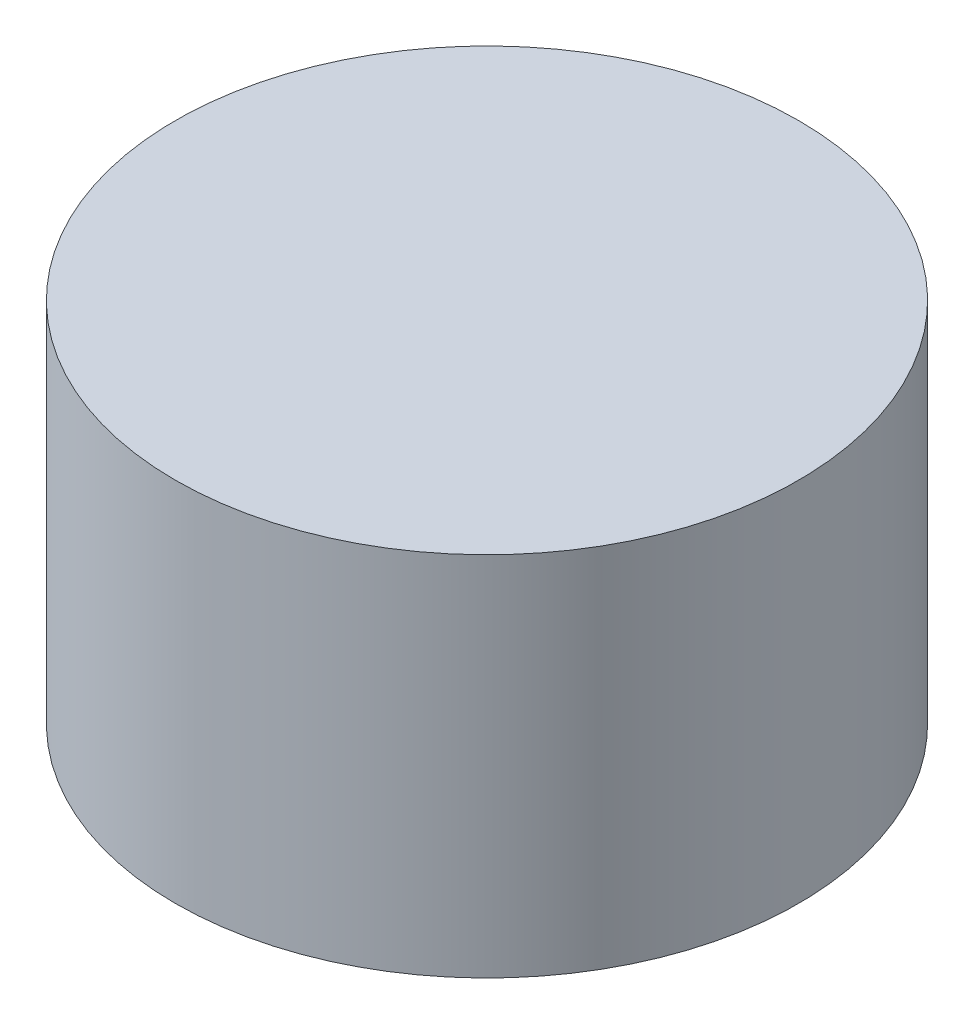
ISO-10303-21;
HEADER;
FILE_DESCRIPTION(('STEP AP214'),'2;1');
FILE_NAME('part.step','',(''),(''),'','','');
FILE_SCHEMA(('AUTOMOTIVE_DESIGN { 1 0 10303 214 1 1 1 1 }'));
ENDSEC;
DATA;
#1=APPLICATION_CONTEXT('core data for automotive mechanical design processes');
#2=APPLICATION_PROTOCOL_DEFINITION('international standard','automotive_design',2000,#1);
#3=PRODUCT_CONTEXT('',#1,'mechanical');
#4=PRODUCT('Part','Part','',(#3));
#5=PRODUCT_RELATED_PRODUCT_CATEGORY('part','',(#4));
#6=PRODUCT_DEFINITION_FORMATION('','',#4);
#7=PRODUCT_DEFINITION_CONTEXT('part definition',#1,'design');
#8=PRODUCT_DEFINITION('design','',#6,#7);
#9=PRODUCT_DEFINITION_SHAPE('','',#8);
#10=(LENGTH_UNIT() NAMED_UNIT(*) SI_UNIT(.MILLI.,.METRE.));
#11=(NAMED_UNIT(*) PLANE_ANGLE_UNIT() SI_UNIT($,.RADIAN.));
#12=(NAMED_UNIT(*) SI_UNIT($,.STERADIAN.) SOLID_ANGLE_UNIT());
#13=UNCERTAINTY_MEASURE_WITH_UNIT(LENGTH_MEASURE(1.E-05),#10,'distance_accuracy_value','');
#14=(GEOMETRIC_REPRESENTATION_CONTEXT(3) GLOBAL_UNCERTAINTY_ASSIGNED_CONTEXT((#13)) GLOBAL_UNIT_ASSIGNED_CONTEXT((#10,
#11,#12)) REPRESENTATION_CONTEXT('',''));
#15=CARTESIAN_POINT('',(0.,0.,0.));
#16=DIRECTION('',(0.,0.,1.));
#17=DIRECTION('',(1.,0.,0.));
#18=AXIS2_PLACEMENT_3D('',#15,#16,#17);
#19=CARTESIAN_POINT('',(0.,12.7,0.));
#20=DIRECTION('',(0.,-1.,0.));
#21=DIRECTION('',(0.,0.,-1.));
#22=AXIS2_PLACEMENT_3D('',#19,#20,#21);
#23=CYLINDRICAL_SURFACE('',#22,10.795);
#24=CARTESIAN_POINT('',(0.,12.7,0.));
#25=DIRECTION('',(0.,1.,0.));
#26=DIRECTION('',(0.,0.,1.));
#27=AXIS2_PLACEMENT_3D('',#24,#25,#26);
#28=CIRCLE('',#27,10.795);
#29=CARTESIAN_POINT('',(0.,12.7,10.795));
#30=VERTEX_POINT('',#29);
#31=EDGE_CURVE('E10',#30,#30,#28,.T.);
#32=ORIENTED_EDGE('',*,*,#31,.F.);
#33=EDGE_LOOP('',(#32));
#34=FACE_BOUND('',#33,.T.);
#35=CARTESIAN_POINT('',(0.,0.,0.));
#36=DIRECTION('',(0.,1.,0.));
#37=DIRECTION('',(0.,0.,1.));
#38=AXIS2_PLACEMENT_3D('',#35,#36,#37);
#39=CIRCLE('',#38,10.795);
#40=CARTESIAN_POINT('',(0.,0.,10.795));
#41=VERTEX_POINT('',#40);
#42=EDGE_CURVE('E34',#41,#41,#39,.T.);
#43=ORIENTED_EDGE('',*,*,#42,.T.);
#44=EDGE_LOOP('',(#43));
#45=FACE_BOUND('',#44,.T.);
#46=ADVANCED_FACE('F31',(#34,#45),#23,.T.);
#47=CARTESIAN_POINT('',(0.,12.7,0.));
#48=DIRECTION('',(0.,1.,0.));
#49=DIRECTION('',(0.,0.,1.));
#50=AXIS2_PLACEMENT_3D('',#47,#48,#49);
#51=PLANE('',#50);
#52=ORIENTED_EDGE('',*,*,#31,.T.);
#53=EDGE_LOOP('',(#52));
#54=FACE_BOUND('',#53,.T.);
#55=ADVANCED_FACE('F46',(#54),#51,.T.);
#56=CARTESIAN_POINT('',(0.,0.,0.));
#57=DIRECTION('',(0.,1.,0.));
#58=DIRECTION('',(0.,0.,1.));
#59=AXIS2_PLACEMENT_3D('',#56,#57,#58);
#60=PLANE('',#59);
#61=ORIENTED_EDGE('',*,*,#42,.F.);
#62=EDGE_LOOP('',(#61));
#63=FACE_BOUND('',#62,.T.);
#64=ADVANCED_FACE('F44',(#63),#60,.F.);
#65=CLOSED_SHELL('',(#46,#55,#64));
#66=MANIFOLD_SOLID_BREP('B2',#65);
#67=ADVANCED_BREP_SHAPE_REPRESENTATION('',(#18,#66),#14);
#68=SHAPE_DEFINITION_REPRESENTATION(#9,#67);
ENDSEC;
END-ISO-10303-21;
